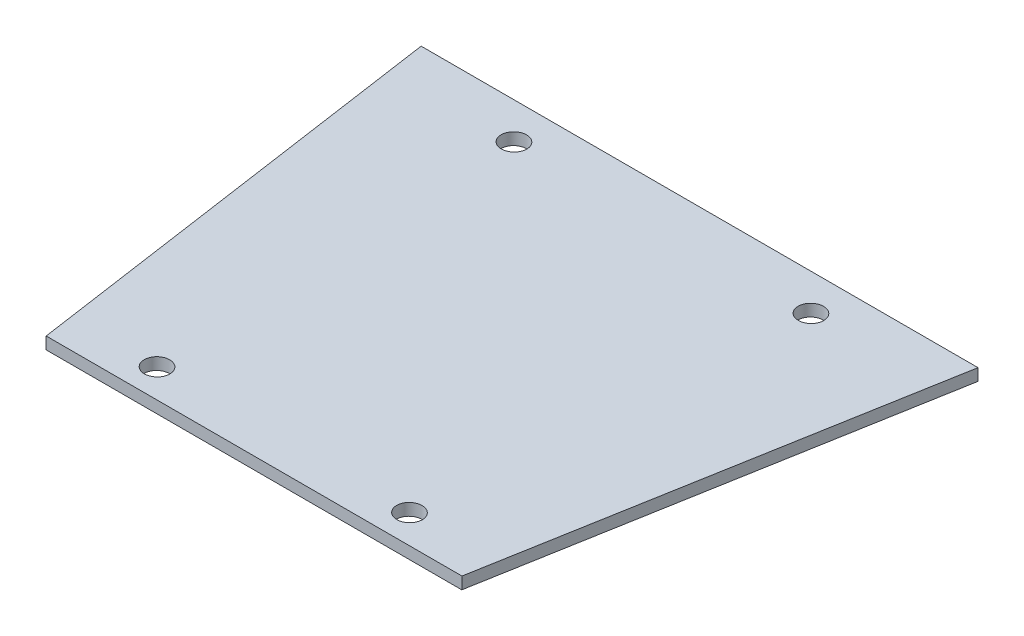
ISO-10303-21;
HEADER;
FILE_DESCRIPTION(('STEP AP214'),'2;1');
FILE_NAME('part.step','',(''),(''),'','','');
FILE_SCHEMA(('AUTOMOTIVE_DESIGN { 1 0 10303 214 1 1 1 1 }'));
ENDSEC;
DATA;
#1=APPLICATION_CONTEXT('core data for automotive mechanical design processes');
#2=APPLICATION_PROTOCOL_DEFINITION('international standard','automotive_design',2000,#1);
#3=PRODUCT_CONTEXT('',#1,'mechanical');
#4=PRODUCT('Part','Part','',(#3));
#5=PRODUCT_RELATED_PRODUCT_CATEGORY('part','',(#4));
#6=PRODUCT_DEFINITION_FORMATION('','',#4);
#7=PRODUCT_DEFINITION_CONTEXT('part definition',#1,'design');
#8=PRODUCT_DEFINITION('design','',#6,#7);
#9=PRODUCT_DEFINITION_SHAPE('','',#8);
#10=(LENGTH_UNIT() NAMED_UNIT(*) SI_UNIT(.MILLI.,.METRE.));
#11=(NAMED_UNIT(*) PLANE_ANGLE_UNIT() SI_UNIT($,.RADIAN.));
#12=(NAMED_UNIT(*) SI_UNIT($,.STERADIAN.) SOLID_ANGLE_UNIT());
#13=UNCERTAINTY_MEASURE_WITH_UNIT(LENGTH_MEASURE(1.E-05),#10,'distance_accuracy_value','');
#14=(GEOMETRIC_REPRESENTATION_CONTEXT(3) GLOBAL_UNCERTAINTY_ASSIGNED_CONTEXT((#13)) GLOBAL_UNIT_ASSIGNED_CONTEXT((#10,
#11,#12)) REPRESENTATION_CONTEXT('',''));
#15=CARTESIAN_POINT('',(0.,0.,0.));
#16=DIRECTION('',(0.,0.,1.));
#17=DIRECTION('',(1.,0.,0.));
#18=AXIS2_PLACEMENT_3D('',#15,#16,#17);
#19=CARTESIAN_POINT('',(-37.5,-26.5998020288418,-48.9398311995993));
#20=DIRECTION('',(0.,0.0157305002504064,0.999876268026135));
#21=DIRECTION('',(0.,-0.999876268026135,0.0157305002504064));
#22=AXIS2_PLACEMENT_3D('',#19,#20,#21);
#23=PLANE('',#22);
#24=DIRECTION('',(1.,0.,0.));
#25=VECTOR('',#24,1.);
#26=CARTESIAN_POINT('',(-37.5,-25.,-48.965));
#27=LINE('',#26,#25);
#28=CARTESIAN_POINT('',(-37.5,-25.,-48.965));
#29=VERTEX_POINT('',#28);
#30=CARTESIAN_POINT('',(37.5,-25.,-48.965));
#31=VERTEX_POINT('',#30);
#32=EDGE_CURVE('E127',#29,#31,#27,.T.);
#33=ORIENTED_EDGE('',*,*,#32,.T.);
#34=DIRECTION('',(0.,0.999876268026135,-0.0157305002504064));
#35=VECTOR('',#34,1.);
#36=CARTESIAN_POINT('',(37.5,-26.5998020288418,-48.9398311995993));
#37=LINE('',#36,#35);
#38=CARTESIAN_POINT('',(37.5,-26.5998020288418,-48.9398311995993));
#39=VERTEX_POINT('',#38);
#40=EDGE_CURVE('E12',#39,#31,#37,.T.);
#41=ORIENTED_EDGE('',*,*,#40,.F.);
#42=DIRECTION('',(1.,0.,0.));
#43=VECTOR('',#42,1.);
#44=CARTESIAN_POINT('',(-37.5,-26.5998020288418,-48.9398311995993));
#45=LINE('',#44,#43);
#46=CARTESIAN_POINT('',(-37.5,-26.5998020288418,-48.9398311995993));
#47=VERTEX_POINT('',#46);
#48=EDGE_CURVE('E109',#47,#39,#45,.T.);
#49=ORIENTED_EDGE('',*,*,#48,.F.);
#50=DIRECTION('',(0.,0.999876268026135,-0.0157305002504064));
#51=VECTOR('',#50,1.);
#52=CARTESIAN_POINT('',(-37.5,-26.5998020288418,-48.9398311995993));
#53=LINE('',#52,#51);
#54=EDGE_CURVE('E123',#47,#29,#53,.T.);
#55=ORIENTED_EDGE('',*,*,#54,.T.);
#56=EDGE_LOOP('',(#33,#41,#49,#55));
#57=FACE_BOUND('',#56,.T.);
#58=ADVANCED_FACE('F44',(#57),#23,.F.);
#59=CARTESIAN_POINT('',(37.5,-26.5998020288418,-48.9398311995993));
#60=DIRECTION('',(-0.987699127302722,-0.00245972083303976,-0.156346997728975));
#61=DIRECTION('',(-0.156347470698502,0.,0.987702115218035));
#62=AXIS2_PLACEMENT_3D('',#59,#60,#61);
#63=PLANE('',#62);
#64=DIRECTION('',(-0.156366345245518,0.0155370013693617,0.987576917340117));
#65=VECTOR('',#64,1.);
#66=CARTESIAN_POINT('',(37.5,-25.,-48.965));
#67=LINE('',#66,#65);
#68=CARTESIAN_POINT('',(28.,-24.0560531885734,11.035));
#69=VERTEX_POINT('',#68);
#70=EDGE_CURVE('E114',#31,#69,#67,.T.);
#71=ORIENTED_EDGE('',*,*,#70,.T.);
#72=DIRECTION('',(0.,0.999876268026135,-0.0157305002504064));
#73=VECTOR('',#72,1.);
#74=CARTESIAN_POINT('',(28.,-25.6558552174152,11.0601688004007));
#75=LINE('',#74,#73);
#76=CARTESIAN_POINT('',(28.,-25.6558552174152,11.0601688004007));
#77=VERTEX_POINT('',#76);
#78=EDGE_CURVE('E61',#77,#69,#75,.T.);
#79=ORIENTED_EDGE('',*,*,#78,.F.);
#80=DIRECTION('',(-0.156366345245518,0.0155370013693617,0.987576917340117));
#81=VECTOR('',#80,1.);
#82=CARTESIAN_POINT('',(37.5,-26.5998020288418,-48.9398311995993));
#83=LINE('',#82,#81);
#84=EDGE_CURVE('E104',#39,#77,#83,.T.);
#85=ORIENTED_EDGE('',*,*,#84,.F.);
#86=ORIENTED_EDGE('',*,*,#40,.T.);
#87=EDGE_LOOP('',(#71,#79,#85,#86));
#88=FACE_BOUND('',#87,.T.);
#89=ADVANCED_FACE('F113',(#88),#63,.F.);
#90=CARTESIAN_POINT('',(28.,-25.6558552174152,11.0601688004007));
#91=DIRECTION('',(0.,-0.0157305002504064,-0.999876268026135));
#92=DIRECTION('',(0.,0.999876268026135,-0.0157305002504064));
#93=AXIS2_PLACEMENT_3D('',#90,#91,#92);
#94=PLANE('',#93);
#95=DIRECTION('',(-1.,0.,0.));
#96=VECTOR('',#95,1.);
#97=CARTESIAN_POINT('',(28.,-24.0560531885734,11.035));
#98=LINE('',#97,#96);
#99=CARTESIAN_POINT('',(-28.,-24.0560531885734,11.035));
#100=VERTEX_POINT('',#99);
#101=EDGE_CURVE('E91',#69,#100,#98,.T.);
#102=ORIENTED_EDGE('',*,*,#101,.T.);
#103=DIRECTION('',(0.,0.999876268026135,-0.0157305002504064));
#104=VECTOR('',#103,1.);
#105=CARTESIAN_POINT('',(-28.,-25.6558552174152,11.0601688004007));
#106=LINE('',#105,#104);
#107=CARTESIAN_POINT('',(-28.,-25.6558552174152,11.0601688004007));
#108=VERTEX_POINT('',#107);
#109=EDGE_CURVE('E115',#108,#100,#106,.T.);
#110=ORIENTED_EDGE('',*,*,#109,.F.);
#111=DIRECTION('',(-1.,0.,0.));
#112=VECTOR('',#111,1.);
#113=CARTESIAN_POINT('',(28.,-25.6558552174152,11.0601688004007));
#114=LINE('',#113,#112);
#115=EDGE_CURVE('E107',#77,#108,#114,.T.);
#116=ORIENTED_EDGE('',*,*,#115,.F.);
#117=ORIENTED_EDGE('',*,*,#78,.T.);
#118=EDGE_LOOP('',(#102,#110,#116,#117));
#119=FACE_BOUND('',#118,.T.);
#120=ADVANCED_FACE('F117',(#119),#94,.F.);
#121=CARTESIAN_POINT('',(-28.,-25.6558552174152,11.0601688004007));
#122=DIRECTION('',(0.987699127302722,-0.00245972083303976,-0.156346997728975));
#123=DIRECTION('',(-0.156347470698502,0.,-0.987702115218035));
#124=AXIS2_PLACEMENT_3D('',#121,#122,#123);
#125=PLANE('',#124);
#126=DIRECTION('',(-0.156366345245518,-0.0155370013693617,-0.987576917340117));
#127=VECTOR('',#126,1.);
#128=CARTESIAN_POINT('',(-28.,-24.0560531885734,11.035));
#129=LINE('',#128,#127);
#130=EDGE_CURVE('E97',#100,#29,#129,.T.);
#131=ORIENTED_EDGE('',*,*,#130,.T.);
#132=ORIENTED_EDGE('',*,*,#54,.F.);
#133=DIRECTION('',(-0.156366345245518,-0.0155370013693617,-0.987576917340117));
#134=VECTOR('',#133,1.);
#135=CARTESIAN_POINT('',(-28.,-25.6558552174152,11.0601688004007));
#136=LINE('',#135,#134);
#137=EDGE_CURVE('E70',#108,#47,#136,.T.);
#138=ORIENTED_EDGE('',*,*,#137,.F.);
#139=ORIENTED_EDGE('',*,*,#109,.T.);
#140=EDGE_LOOP('',(#131,#132,#138,#139));
#141=FACE_BOUND('',#140,.T.);
#142=ADVANCED_FACE('F204',(#141),#125,.F.);
#143=CARTESIAN_POINT('',(0.,-25.8234671719311,0.406266324948725));
#144=DIRECTION('',(0.,-0.999876268026135,0.0157305002504064));
#145=DIRECTION('',(0.,-0.0157305002504064,-0.999876268026135));
#146=AXIS2_PLACEMENT_3D('',#143,#144,#145);
#147=PLANE('',#146);
#148=CARTESIAN_POINT('',(-15.3,-25.7176912052735,7.12969387683311));
#149=CARTESIAN_POINT('',(-15.3000074575271,-25.715945896312,7.24063078177578));
#150=CARTESIAN_POINT('',(-15.3109153937537,-25.7141978684662,7.35174050689907));
#151=CARTESIAN_POINT('',(-15.3542110407633,-25.7107665045529,7.56984795988687));
#152=CARTESIAN_POINT('',(-15.3866406976351,-25.7090833016216,7.67683722523122));
#153=CARTESIAN_POINT('',(-15.4657406471072,-25.7060761577841,7.86798001851794));
#154=CARTESIAN_POINT('',(-15.5097769426127,-25.7047349335491,7.95323212501503));
#155=CARTESIAN_POINT('',(-15.6115030106041,-25.702188875128,8.11506699051708));
#156=CARTESIAN_POINT('',(-15.6691802924556,-25.7009839176498,8.19165758632145));
#157=CARTESIAN_POINT('',(-15.7965939340605,-25.6987429669558,8.33409891882883));
#158=CARTESIAN_POINT('',(-15.8663348125166,-25.6977070373371,8.39994561312714));
#159=CARTESIAN_POINT('',(-16.0158945704555,-25.6958338803725,8.51900890834308));
#160=CARTESIAN_POINT('',(-16.0957150837197,-25.6949966853025,8.5722234577138));
#161=CARTESIAN_POINT('',(-16.2631525622895,-25.6935450531779,8.66449341023633));
#162=CARTESIAN_POINT('',(-16.3507689599073,-25.69293059992,8.7035498433176));
#163=CARTESIAN_POINT('',(-16.5313145609368,-25.6919418123062,8.766400054905));
#164=CARTESIAN_POINT('',(-16.6242436764269,-25.6915674739779,8.79019408591289));
#165=CARTESIAN_POINT('',(-16.8127790158677,-25.6910695250353,8.82184516645357));
#166=CARTESIAN_POINT('',(-16.9083852665919,-25.6909459169295,8.8297020565445));
#167=CARTESIAN_POINT('',(-17.099559683929,-25.6909529444979,8.82925536389327));
#168=CARTESIAN_POINT('',(-17.1951278506659,-25.6910835793371,8.82095183422734));
#169=CARTESIAN_POINT('',(-17.383513548985,-25.6915953829523,8.78842011046653));
#170=CARTESIAN_POINT('',(-17.4763310798676,-25.6919765517921,8.76419191232242));
#171=CARTESIAN_POINT('',(-17.6565809292291,-25.692978604664,8.70049852240995));
#172=CARTESIAN_POINT('',(-17.7440132323654,-25.6935994893791,8.66103328723338));
#173=CARTESIAN_POINT('',(-17.9110103123298,-25.6950633481809,8.56798617161037));
#174=CARTESIAN_POINT('',(-17.9905750958791,-25.6959063220778,8.51440430322373));
#175=CARTESIAN_POINT('',(-18.1395785182171,-25.6977904287752,8.39464501120082));
#176=CARTESIAN_POINT('',(-18.2090171692155,-25.6988315613367,8.32846760275202));
#177=CARTESIAN_POINT('',(-18.3357973030139,-25.7010824317239,8.18539574574242));
#178=CARTESIAN_POINT('',(-18.3931387820436,-25.702292169602,8.10850129384152));
#179=CARTESIAN_POINT('',(-18.4940968087333,-25.704845910012,7.94617813882791));
#180=CARTESIAN_POINT('',(-18.5377133508061,-25.7061899125984,7.86074943224111));
#181=CARTESIAN_POINT('',(-18.6099833161547,-25.7089740293722,7.68378288666455));
#182=CARTESIAN_POINT('',(-18.6386367430484,-25.7104141435363,7.59224504915195));
#183=CARTESIAN_POINT('',(-18.6801671041193,-25.7133496029475,7.40565872612519));
#184=CARTESIAN_POINT('',(-18.693044040377,-25.7148449481875,7.31061024107402));
#185=CARTESIAN_POINT('',(-18.7026558882231,-25.7178484213969,7.11970076356794));
#186=CARTESIAN_POINT('',(-18.6993908006282,-25.7193565493657,7.02383977115413));
#187=CARTESIAN_POINT('',(-18.6768112880253,-25.7223427769155,6.83402647784223));
#188=CARTESIAN_POINT('',(-18.6574968616853,-25.723820876494,6.74007417710255));
#189=CARTESIAN_POINT('',(-18.6033669487931,-25.7267050882885,6.55674530138723));
#190=CARTESIAN_POINT('',(-18.5685514615969,-25.7281112005016,6.46736872660174));
#191=CARTESIAN_POINT('',(-18.4844077453043,-25.7308115218504,6.29572846152964));
#192=CARTESIAN_POINT('',(-18.4350795189959,-25.7321057310076,6.21346476987658));
#193=CARTESIAN_POINT('',(-18.3233106118578,-25.73454550759,6.05838548662219));
#194=CARTESIAN_POINT('',(-18.2608699328263,-25.7356910750357,5.98556989372516));
#195=CARTESIAN_POINT('',(-18.1246485884423,-25.7378010498144,5.85145377066107));
#196=CARTESIAN_POINT('',(-18.0508679165597,-25.7387654570433,5.7901532471251));
#197=CARTESIAN_POINT('',(-17.8940609689405,-25.7404857341267,5.68080744102837));
#198=CARTESIAN_POINT('',(-17.8110346881971,-25.7412416038684,5.63276216564596));
#199=CARTESIAN_POINT('',(-17.6380936271831,-25.7425233482509,5.5512907712652));
#200=CARTESIAN_POINT('',(-17.5481788569836,-25.7430492232279,5.51786463089404));
#201=CARTESIAN_POINT('',(-17.3640128935392,-25.7438560484084,5.46658047988007));
#202=CARTESIAN_POINT('',(-17.2697617016936,-25.7441369986908,5.44872246421387));
#203=CARTESIAN_POINT('',(-17.0795991206199,-25.7444460115489,5.4290807097655));
#204=CARTESIAN_POINT('',(-16.9836877275647,-25.7444740735414,5.42729700804229));
#205=CARTESIAN_POINT('',(-16.7929243050332,-25.744276468143,5.43985738089908));
#206=CARTESIAN_POINT('',(-16.698072272207,-25.7440508015544,5.45420140446876));
#207=CARTESIAN_POINT('',(-16.5121328824923,-25.7433523085507,5.49859964779604));
#208=CARTESIAN_POINT('',(-16.421045541164,-25.7428794811141,5.52865393248048));
#209=CARTESIAN_POINT('',(-16.2451689618318,-25.7416994601344,5.60365949203851));
#210=CARTESIAN_POINT('',(-16.1603799035833,-25.7409922599053,5.64861119189014));
#211=CARTESIAN_POINT('',(-16.0398538950777,-25.7397723142387,5.72615448046165));
#212=CARTESIAN_POINT('',(-16.0007819641238,-25.7393390526166,5.75369384710073));
#213=CARTESIAN_POINT('',(-15.9250548331084,-25.7384219371265,5.81198837041566));
#214=CARTESIAN_POINT('',(-15.8884019977871,-25.7379380349161,5.84274659987375));
#215=CARTESIAN_POINT('',(-15.782583910405,-25.7364165293497,5.93945791122831));
#216=CARTESIAN_POINT('',(-15.7174512204564,-25.735308032964,6.00991715992789));
#217=CARTESIAN_POINT('',(-15.5999604318101,-25.7329346313914,6.16077745484117));
#218=CARTESIAN_POINT('',(-15.5476019692009,-25.7316697306618,6.2411782177431));
#219=CARTESIAN_POINT('',(-15.4797371971144,-25.7296825301218,6.36749045372494));
#220=CARTESIAN_POINT('',(-15.4588772754744,-25.7290043546643,6.41059725482617));
#221=CARTESIAN_POINT('',(-15.4208797937376,-25.7276234558045,6.49837119567405));
#222=CARTESIAN_POINT('',(-15.4037390936828,-25.7269207536953,6.54303698196598));
#223=CARTESIAN_POINT('',(-15.3581149310422,-25.7247839311414,6.6788596275671));
#224=CARTESIAN_POINT('',(-15.3353268392319,-25.7233180848483,6.77203307391357));
#225=CARTESIAN_POINT('',(-15.3136958040561,-25.7211494939524,6.90987500756469));
#226=CARTESIAN_POINT('',(-15.3085663040028,-25.7204605611036,6.9536655796893));
#227=CARTESIAN_POINT('',(-15.3017164191259,-25.7190782979494,7.04152623905005));
#228=CARTESIAN_POINT('',(-15.2999970356295,-25.7183849664123,7.08559640457471));
#229=CARTESIAN_POINT('',(-15.3,-25.7176912052735,7.12969387683311));
#230=B_SPLINE_CURVE_WITH_KNOTS('',3,(#148,#149,#150,#151,#152,#153,#154,#155,#156,#157,#158,
#159,#160,#161,#162,#163,#164,#165,#166,#167,#168,#169,#170,#171,#172,#173,#174,#175,#176,#177,
#178,#179,#180,#181,#182,#183,#184,#185,#186,#187,#188,#189,#190,#191,#192,#193,#194,#195,#196,
#197,#198,#199,#200,#201,#202,#203,#204,#205,#206,#207,#208,#209,#210,#211,#212,#213,#214,#215,
#216,#217,#218,#219,#220,#221,#222,#223,#224,#225,#226,#227,#228,#229),.UNSPECIFIED.,.T.,.F.,(4,
2,2,2,2,2,2,2,2,2,2,2,2,2,2,2,2,2,2,2,2,2,2,2,2,2,2,2,2,2,2,2,2,2,2,2,2,2,2,2,4),(0.,
0.332630497506824,0.665911207256757,0.952465656796069,1.23875872618724,1.5251592664983,
1.81160628844606,2.09803246867666,2.38445391013945,2.6708782170688,2.95730158328657,
3.24372502233473,3.53014927736965,3.81657328771387,4.10299695269568,4.3894207069455,
4.67584457779209,4.96226837938307,5.2486921431999,5.53511589252322,5.82153966561916,
6.10796345061715,6.39438718059008,6.68081087128345,6.9672347269171,7.25365873766293,
7.54008232966262,7.82650582924143,8.11292998916312,8.39935324315752,8.68577768088173,
8.97221029012922,9.11547623830682,9.25888022024597,9.54530812209807,9.83172786325189,
9.9752557296505,10.1186619468678,10.4048310046024,10.5370129774897,10.6692337577943),.UNSPECIFIED.);
#231=CARTESIAN_POINT('',(-15.3,-25.7176912052735,7.12969387683311));
#232=VERTEX_POINT('',#231);
#233=EDGE_CURVE('E154',#232,#232,#230,.T.);
#234=ORIENTED_EDGE('',*,*,#233,.F.);
#235=EDGE_LOOP('',(#234));
#236=FACE_BOUND('',#235,.T.);
#237=CARTESIAN_POINT('',(18.7,-25.7176912052735,7.12969387683311));
#238=CARTESIAN_POINT('',(18.6999925424729,-25.715945896312,7.24063078177578));
#239=CARTESIAN_POINT('',(18.6890846062463,-25.7141978684662,7.35174050689907));
#240=CARTESIAN_POINT('',(18.6457889592367,-25.7107665045529,7.56984795988687));
#241=CARTESIAN_POINT('',(18.6133593023649,-25.7090833016216,7.67683722523122));
#242=CARTESIAN_POINT('',(18.5342593528928,-25.7060761577841,7.86798001851794));
#243=CARTESIAN_POINT('',(18.4902230573873,-25.7047349335491,7.95323212501503));
#244=CARTESIAN_POINT('',(18.3884969893959,-25.702188875128,8.11506699051708));
#245=CARTESIAN_POINT('',(18.3308197075444,-25.7009839176498,8.19165758632145));
#246=CARTESIAN_POINT('',(18.2034060659395,-25.6987429669558,8.33409891882883));
#247=CARTESIAN_POINT('',(18.1336651874834,-25.6977070373371,8.39994561312714));
#248=CARTESIAN_POINT('',(17.9841054295445,-25.6958338803725,8.51900890834308));
#249=CARTESIAN_POINT('',(17.9042849162803,-25.6949966853025,8.5722234577138));
#250=CARTESIAN_POINT('',(17.7368474377105,-25.6935450531779,8.66449341023633));
#251=CARTESIAN_POINT('',(17.6492310400927,-25.69293059992,8.7035498433176));
#252=CARTESIAN_POINT('',(17.4686854390632,-25.6919418123062,8.766400054905));
#253=CARTESIAN_POINT('',(17.3757563235731,-25.6915674739779,8.79019408591289));
#254=CARTESIAN_POINT('',(17.1872209841323,-25.6910695250353,8.82184516645357));
#255=CARTESIAN_POINT('',(17.0916147334081,-25.6909459169295,8.8297020565445));
#256=CARTESIAN_POINT('',(16.900440316071,-25.6909529444979,8.82925536389327));
#257=CARTESIAN_POINT('',(16.8048721493341,-25.6910835793371,8.82095183422734));
#258=CARTESIAN_POINT('',(16.6164864510151,-25.6915953829523,8.78842011046653));
#259=CARTESIAN_POINT('',(16.5236689201324,-25.6919765517921,8.76419191232242));
#260=CARTESIAN_POINT('',(16.3434190707709,-25.692978604664,8.70049852240995));
#261=CARTESIAN_POINT('',(16.2559867676346,-25.6935994893791,8.66103328723338));
#262=CARTESIAN_POINT('',(16.0889896876702,-25.6950633481809,8.56798617161037));
#263=CARTESIAN_POINT('',(16.0094249041209,-25.6959063220778,8.51440430322373));
#264=CARTESIAN_POINT('',(15.8604214817829,-25.6977904287752,8.39464501120082));
#265=CARTESIAN_POINT('',(15.7909828307845,-25.6988315613367,8.32846760275202));
#266=CARTESIAN_POINT('',(15.6642026969861,-25.7010824317239,8.18539574574242));
#267=CARTESIAN_POINT('',(15.6068612179564,-25.702292169602,8.10850129384152));
#268=CARTESIAN_POINT('',(15.5059031912667,-25.704845910012,7.94617813882791));
#269=CARTESIAN_POINT('',(15.4622866491939,-25.7061899125984,7.8607494322411));
#270=CARTESIAN_POINT('',(15.3900166838453,-25.7089740293722,7.68378288666455));
#271=CARTESIAN_POINT('',(15.3613632569516,-25.7104141435363,7.59224504915195));
#272=CARTESIAN_POINT('',(15.3198328958807,-25.7133496029475,7.40565872612519));
#273=CARTESIAN_POINT('',(15.306955959623,-25.7148449481875,7.31061024107402));
#274=CARTESIAN_POINT('',(15.2973441117769,-25.7178484213969,7.11970076356794));
#275=CARTESIAN_POINT('',(15.3006091993718,-25.7193565493657,7.02383977115414));
#276=CARTESIAN_POINT('',(15.3231887119747,-25.7223427769155,6.83402647784223));
#277=CARTESIAN_POINT('',(15.3425031383147,-25.723820876494,6.74007417710255));
#278=CARTESIAN_POINT('',(15.3966330512069,-25.7267050882885,6.55674530138723));
#279=CARTESIAN_POINT('',(15.4314485384031,-25.7281112005016,6.46736872660174));
#280=CARTESIAN_POINT('',(15.5155922546957,-25.7308115218504,6.29572846152964));
#281=CARTESIAN_POINT('',(15.5649204810041,-25.7321057310076,6.21346476987658));
#282=CARTESIAN_POINT('',(15.6766893881422,-25.73454550759,6.05838548662219));
#283=CARTESIAN_POINT('',(15.7391300671737,-25.7356910750357,5.98556989372517));
#284=CARTESIAN_POINT('',(15.8753514115577,-25.7378010498144,5.85145377066107));
#285=CARTESIAN_POINT('',(15.9491320834403,-25.7387654570433,5.79015324712511));
#286=CARTESIAN_POINT('',(16.1059390310595,-25.7404857341267,5.68080744102837));
#287=CARTESIAN_POINT('',(16.1889653118029,-25.7412416038684,5.63276216564597));
#288=CARTESIAN_POINT('',(16.3619063728169,-25.7425233482509,5.55129077126521));
#289=CARTESIAN_POINT('',(16.4518211430164,-25.7430492232279,5.51786463089404));
#290=CARTESIAN_POINT('',(16.6359871064608,-25.7438560484084,5.46658047988007));
#291=CARTESIAN_POINT('',(16.7302382983064,-25.7441369986908,5.44872246421387));
#292=CARTESIAN_POINT('',(16.9204008793802,-25.7444460115489,5.4290807097655));
#293=CARTESIAN_POINT('',(17.0163122724353,-25.7444740735414,5.42729700804229));
#294=CARTESIAN_POINT('',(17.2070756949669,-25.744276468143,5.43985738089908));
#295=CARTESIAN_POINT('',(17.301927727793,-25.7440508015544,5.45420140446876));
#296=CARTESIAN_POINT('',(17.4878671175077,-25.7433523085507,5.49859964779604));
#297=CARTESIAN_POINT('',(17.578954458836,-25.7428794811141,5.52865393248048));
#298=CARTESIAN_POINT('',(17.7548310381682,-25.7416994601344,5.60365949203851));
#299=CARTESIAN_POINT('',(17.8396200964167,-25.7409922599053,5.64861119189014));
#300=CARTESIAN_POINT('',(17.9601461049223,-25.7397723142387,5.72615448046165));
#301=CARTESIAN_POINT('',(17.9992180358762,-25.7393390526166,5.75369384710073));
#302=CARTESIAN_POINT('',(18.0749451668916,-25.7384219371265,5.81198837041566));
#303=CARTESIAN_POINT('',(18.1115980022129,-25.7379380349161,5.84274659987375));
#304=CARTESIAN_POINT('',(18.217416089595,-25.7364165293497,5.93945791122831));
#305=CARTESIAN_POINT('',(18.2825487795436,-25.735308032964,6.00991715992789));
#306=CARTESIAN_POINT('',(18.4000395681899,-25.7329346313914,6.16077745484116));
#307=CARTESIAN_POINT('',(18.4523980307991,-25.7316697306618,6.2411782177431));
#308=CARTESIAN_POINT('',(18.5202628028856,-25.7296825301218,6.36749045372494));
#309=CARTESIAN_POINT('',(18.5411227245256,-25.7290043546643,6.41059725482616));
#310=CARTESIAN_POINT('',(18.5791202062624,-25.7276234558045,6.49837119567405));
#311=CARTESIAN_POINT('',(18.5962609063172,-25.7269207536953,6.54303698196598));
#312=CARTESIAN_POINT('',(18.6418850689578,-25.7247839311414,6.6788596275671));
#313=CARTESIAN_POINT('',(18.6646731607681,-25.7233180848483,6.77203307391357));
#314=CARTESIAN_POINT('',(18.6863041959439,-25.7211494939524,6.90987500756469));
#315=CARTESIAN_POINT('',(18.6914336959972,-25.7204605611036,6.9536655796893));
#316=CARTESIAN_POINT('',(18.6982835808741,-25.7190782979494,7.04152623905005));
#317=CARTESIAN_POINT('',(18.7000029643705,-25.7183849664123,7.08559640457471));
#318=CARTESIAN_POINT('',(18.7,-25.7176912052735,7.12969387683311));
#319=B_SPLINE_CURVE_WITH_KNOTS('',3,(#237,#238,#239,#240,#241,#242,#243,#244,#245,#246,#247,
#248,#249,#250,#251,#252,#253,#254,#255,#256,#257,#258,#259,#260,#261,#262,#263,#264,#265,#266,
#267,#268,#269,#270,#271,#272,#273,#274,#275,#276,#277,#278,#279,#280,#281,#282,#283,#284,#285,
#286,#287,#288,#289,#290,#291,#292,#293,#294,#295,#296,#297,#298,#299,#300,#301,#302,#303,#304,
#305,#306,#307,#308,#309,#310,#311,#312,#313,#314,#315,#316,#317,#318),.UNSPECIFIED.,.T.,.F.,(4,
2,2,2,2,2,2,2,2,2,2,2,2,2,2,2,2,2,2,2,2,2,2,2,2,2,2,2,2,2,2,2,2,2,2,2,2,2,2,2,4),(0.,
0.332630497506824,0.665911207256758,0.952465656796071,1.23875872618724,1.5251592664983,
1.81160628844606,2.09803246867666,2.38445391013945,2.6708782170688,2.95730158328657,
3.24372502233473,3.53014927736965,3.81657328771387,4.10299695269568,4.3894207069455,
4.67584457779209,4.96226837938307,5.24869214319989,5.53511589252322,5.82153966561916,
6.10796345061714,6.39438718059007,6.68081087128345,6.9672347269171,7.25365873766293,
7.54008232966262,7.82650582924143,8.11292998916313,8.39935324315752,8.68577768088173,
8.97221029012922,9.11547623830682,9.25888022024597,9.54530812209807,9.8317278632519,
9.9752557296505,10.1186619468678,10.4048310046024,10.5370129774897,10.6692337577943),.UNSPECIFIED.);
#320=CARTESIAN_POINT('',(18.7,-25.7176912052735,7.12969387683311));
#321=VERTEX_POINT('',#320);
#322=EDGE_CURVE('E147',#321,#321,#319,.T.);
#323=ORIENTED_EDGE('',*,*,#322,.F.);
#324=EDGE_LOOP('',(#323));
#325=FACE_BOUND('',#324,.T.);
#326=CARTESIAN_POINT('',(20.,-26.5211495275898,-43.9404498594687));
#327=DIRECTION('',(0.,-0.999876268026135,0.0157305002504064));
#328=DIRECTION('',(0.,-0.0157305002504064,-0.999876268026135));
#329=AXIS2_PLACEMENT_3D('',#326,#327,#328);
#330=CIRCLE('',#329,1.7);
#331=CARTESIAN_POINT('',(20.,-26.5478913780155,-45.6402395151131));
#332=VERTEX_POINT('',#331);
#333=EDGE_CURVE('E143',#332,#332,#330,.T.);
#334=ORIENTED_EDGE('',*,*,#333,.F.);
#335=EDGE_LOOP('',(#334));
#336=FACE_BOUND('',#335,.T.);
#337=CARTESIAN_POINT('',(-20.,-26.5211495275898,-43.9404498594687));
#338=DIRECTION('',(0.,-0.999876268026135,0.0157305002504064));
#339=DIRECTION('',(0.,-0.0157305002504064,-0.999876268026135));
#340=AXIS2_PLACEMENT_3D('',#337,#338,#339);
#341=CIRCLE('',#340,1.7);
#342=CARTESIAN_POINT('',(-20.,-26.5478913780155,-45.6402395151131));
#343=VERTEX_POINT('',#342);
#344=EDGE_CURVE('E181',#343,#343,#341,.T.);
#345=ORIENTED_EDGE('',*,*,#344,.F.);
#346=EDGE_LOOP('',(#345));
#347=FACE_BOUND('',#346,.T.);
#348=ORIENTED_EDGE('',*,*,#48,.T.);
#349=ORIENTED_EDGE('',*,*,#84,.T.);
#350=ORIENTED_EDGE('',*,*,#115,.T.);
#351=ORIENTED_EDGE('',*,*,#137,.T.);
#352=EDGE_LOOP('',(#348,#349,#350,#351));
#353=FACE_BOUND('',#352,.T.);
#354=ADVANCED_FACE('F105',(#236,#325,#336,#347,#353),#147,.T.);
#355=CARTESIAN_POINT('',(0.,-24.2236651430893,0.381097524548075));
#356=DIRECTION('',(0.,-0.999876268026135,0.0157305002504064));
#357=DIRECTION('',(0.,-0.0157305002504064,-0.999876268026135));
#358=AXIS2_PLACEMENT_3D('',#355,#356,#357);
#359=PLANE('',#358);
#360=CARTESIAN_POINT('',(-15.3,-24.1178891764316,7.10452507643246));
#361=CARTESIAN_POINT('',(-15.3000074575271,-24.1161438674702,7.21546198137513));
#362=CARTESIAN_POINT('',(-15.3109153937537,-24.1143958396243,7.32657170649842));
#363=CARTESIAN_POINT('',(-15.3542110407633,-24.1109644757111,7.54467915948622));
#364=CARTESIAN_POINT('',(-15.3866406976351,-24.1092812727798,7.65166842483057));
#365=CARTESIAN_POINT('',(-15.4657406471072,-24.1062741289423,7.84281121811729));
#366=CARTESIAN_POINT('',(-15.5097769426127,-24.1049329047073,7.92806332461438));
#367=CARTESIAN_POINT('',(-15.6115030106041,-24.1023868462862,8.08989819011643));
#368=CARTESIAN_POINT('',(-15.6691802924556,-24.1011818888079,8.16648878592079));
#369=CARTESIAN_POINT('',(-15.7965939340605,-24.098940938114,8.30893011842818));
#370=CARTESIAN_POINT('',(-15.8663348125166,-24.0979050084953,8.37477681272649));
#371=CARTESIAN_POINT('',(-16.0158945704555,-24.0960318515306,8.49384010794243));
#372=CARTESIAN_POINT('',(-16.0957150837197,-24.0951946564606,8.54705465731315));
#373=CARTESIAN_POINT('',(-16.2631525622895,-24.0937430243361,8.63932460983568));
#374=CARTESIAN_POINT('',(-16.3507689599073,-24.0931285710782,8.67838104291695));
#375=CARTESIAN_POINT('',(-16.5313145609368,-24.0921397834644,8.74123125450435));
#376=CARTESIAN_POINT('',(-16.6242436764269,-24.0917654451361,8.76502528551224));
#377=CARTESIAN_POINT('',(-16.8127790158677,-24.0912674961935,8.79667636605292));
#378=CARTESIAN_POINT('',(-16.9083852665919,-24.0911438880877,8.80453325614385));
#379=CARTESIAN_POINT('',(-17.099559683929,-24.0911509156561,8.80408656349262));
#380=CARTESIAN_POINT('',(-17.1951278506659,-24.0912815504953,8.79578303382669));
#381=CARTESIAN_POINT('',(-17.383513548985,-24.0917933541105,8.76325131006588));
#382=CARTESIAN_POINT('',(-17.4763310798676,-24.0921745229503,8.73902311192177));
#383=CARTESIAN_POINT('',(-17.6565809292291,-24.0931765758222,8.6753297220093));
#384=CARTESIAN_POINT('',(-17.7440132323654,-24.0937974605373,8.63586448683273));
#385=CARTESIAN_POINT('',(-17.9110103123298,-24.0952613193391,8.54281737120972));
#386=CARTESIAN_POINT('',(-17.9905750958791,-24.096104293236,8.48923550282308));
#387=CARTESIAN_POINT('',(-18.1395785182171,-24.0979883999334,8.36947621080017));
#388=CARTESIAN_POINT('',(-18.2090171692155,-24.0990295324949,8.30329880235137));
#389=CARTESIAN_POINT('',(-18.3357973030139,-24.1012804028821,8.16022694534177));
#390=CARTESIAN_POINT('',(-18.3931387820436,-24.1024901407602,8.08333249344087));
#391=CARTESIAN_POINT('',(-18.4940968087333,-24.1050438811702,7.92100933842726));
#392=CARTESIAN_POINT('',(-18.5377133508061,-24.1063878837566,7.83558063184046));
#393=CARTESIAN_POINT('',(-18.6099833161547,-24.1091720005304,7.6586140862639));
#394=CARTESIAN_POINT('',(-18.6386367430484,-24.1106121146944,7.5670762487513));
#395=CARTESIAN_POINT('',(-18.6801671041193,-24.1135475741057,7.38048992572454));
#396=CARTESIAN_POINT('',(-18.693044040377,-24.1150429193457,7.28544144067337));
#397=CARTESIAN_POINT('',(-18.7026558882231,-24.118046392555,7.09453196316729));
#398=CARTESIAN_POINT('',(-18.6993908006282,-24.1195545205239,6.99867097075349));
#399=CARTESIAN_POINT('',(-18.6768112880253,-24.1225407480737,6.80885767744158));
#400=CARTESIAN_POINT('',(-18.6574968616853,-24.1240188476521,6.7149053767019));
#401=CARTESIAN_POINT('',(-18.6033669487931,-24.1269030594467,6.53157650098658));
#402=CARTESIAN_POINT('',(-18.5685514615969,-24.1283091716598,6.44219992620108));
#403=CARTESIAN_POINT('',(-18.4844077453043,-24.1310094930086,6.27055966112899));
#404=CARTESIAN_POINT('',(-18.4350795189959,-24.1323037021658,6.18829596947593));
#405=CARTESIAN_POINT('',(-18.3233106118578,-24.1347434787482,6.03321668622154));
#406=CARTESIAN_POINT('',(-18.2608699328263,-24.1358890461938,5.96040109332451));
#407=CARTESIAN_POINT('',(-18.1246485884423,-24.1379990209726,5.82628497026042));
#408=CARTESIAN_POINT('',(-18.0508679165597,-24.1389634282015,5.76498444672445));
#409=CARTESIAN_POINT('',(-17.8940609689405,-24.1406837052849,5.65563864062772));
#410=CARTESIAN_POINT('',(-17.8110346881971,-24.1414395750266,5.60759336524532));
#411=CARTESIAN_POINT('',(-17.6380936271831,-24.1427213194091,5.52612197086455));
#412=CARTESIAN_POINT('',(-17.5481788569836,-24.1432471943861,5.49269583049339));
#413=CARTESIAN_POINT('',(-17.3640128935392,-24.1440540195666,5.44141167947942));
#414=CARTESIAN_POINT('',(-17.2697617016936,-24.144334969849,5.42355366381322));
#415=CARTESIAN_POINT('',(-17.0795991206199,-24.144643982707,5.40391190936485));
#416=CARTESIAN_POINT('',(-16.9836877275647,-24.1446720446996,5.40212820764164));
#417=CARTESIAN_POINT('',(-16.7929243050332,-24.1444744393011,5.41468858049843));
#418=CARTESIAN_POINT('',(-16.698072272207,-24.1442487727126,5.42903260406811));
#419=CARTESIAN_POINT('',(-16.5121328824923,-24.1435502797089,5.47343084739539));
#420=CARTESIAN_POINT('',(-16.421045541164,-24.1430774522723,5.50348513207983));
#421=CARTESIAN_POINT('',(-16.2451689618318,-24.1418974312926,5.57849069163786));
#422=CARTESIAN_POINT('',(-16.1603799035833,-24.1411902310635,5.62344239148949));
#423=CARTESIAN_POINT('',(-16.0398538950777,-24.1399702853969,5.700985680061));
#424=CARTESIAN_POINT('',(-16.0007819641238,-24.1395370237748,5.72852504670007));
#425=CARTESIAN_POINT('',(-15.9250548331084,-24.1386199082847,5.78681957001501));
#426=CARTESIAN_POINT('',(-15.8884019977871,-24.1381360060743,5.8175777994731));
#427=CARTESIAN_POINT('',(-15.782583910405,-24.1366145005079,5.91428911082766));
#428=CARTESIAN_POINT('',(-15.7174512204563,-24.1355060041222,5.98474835952724));
#429=CARTESIAN_POINT('',(-15.5999604318101,-24.1331326025496,6.13560865444051));
#430=CARTESIAN_POINT('',(-15.5476019692009,-24.13186770182,6.21600941734244));
#431=CARTESIAN_POINT('',(-15.4797371971144,-24.12988050128,6.34232165332429));
#432=CARTESIAN_POINT('',(-15.4588772754744,-24.1292023258225,6.38542845442552));
#433=CARTESIAN_POINT('',(-15.4208797937376,-24.1278214269627,6.4732023952734));
#434=CARTESIAN_POINT('',(-15.4037390936828,-24.1271187248535,6.51786818156533));
#435=CARTESIAN_POINT('',(-15.3581149310422,-24.1249819022996,6.65369082716645));
#436=CARTESIAN_POINT('',(-15.3353268392319,-24.1235160560065,6.74686427351292));
#437=CARTESIAN_POINT('',(-15.3136958040561,-24.1213474651106,6.88470620716404));
#438=CARTESIAN_POINT('',(-15.3085663040028,-24.1206585322618,6.92849677928865));
#439=CARTESIAN_POINT('',(-15.3017164191259,-24.1192762691076,7.0163574386494));
#440=CARTESIAN_POINT('',(-15.2999970356295,-24.1185829375705,7.06042760417406));
#441=CARTESIAN_POINT('',(-15.3,-24.1178891764316,7.10452507643246));
#442=B_SPLINE_CURVE_WITH_KNOTS('',3,(#360,#361,#362,#363,#364,#365,#366,#367,#368,#369,#370,
#371,#372,#373,#374,#375,#376,#377,#378,#379,#380,#381,#382,#383,#384,#385,#386,#387,#388,#389,
#390,#391,#392,#393,#394,#395,#396,#397,#398,#399,#400,#401,#402,#403,#404,#405,#406,#407,#408,
#409,#410,#411,#412,#413,#414,#415,#416,#417,#418,#419,#420,#421,#422,#423,#424,#425,#426,#427,
#428,#429,#430,#431,#432,#433,#434,#435,#436,#437,#438,#439,#440,#441),.UNSPECIFIED.,.T.,.F.,(4,
2,2,2,2,2,2,2,2,2,2,2,2,2,2,2,2,2,2,2,2,2,2,2,2,2,2,2,2,2,2,2,2,2,2,2,2,2,2,2,4),(0.,
0.332630497506825,0.665911207256758,0.95246565679607,1.23875872618724,1.52515926649831,
1.81160628844606,2.09803246867666,2.38445391013945,2.6708782170688,2.95730158328657,
3.24372502233473,3.53014927736965,3.81657328771387,4.10299695269568,4.38942070694549,
4.67584457779209,4.96226837938307,5.24869214319989,5.53511589252322,5.82153966561917,
6.10796345061715,6.39438718059008,6.68081087128345,6.9672347269171,7.25365873766293,
7.54008232966262,7.82650582924143,8.11292998916312,8.39935324315752,8.68577768088173,
8.97221029012922,9.11547623830681,9.25888022024597,9.54530812209807,9.83172786325189,
9.9752557296505,10.1186619468678,10.4048310046024,10.5370129774897,10.6692337577943),.UNSPECIFIED.);
#443=CARTESIAN_POINT('',(-15.3,-24.1178891764316,7.10452507643246));
#444=VERTEX_POINT('',#443);
#445=EDGE_CURVE('E50',#444,#444,#442,.T.);
#446=ORIENTED_EDGE('',*,*,#445,.T.);
#447=EDGE_LOOP('',(#446));
#448=FACE_BOUND('',#447,.T.);
#449=CARTESIAN_POINT('',(18.7,-24.1178891764316,7.10452507643246));
#450=CARTESIAN_POINT('',(18.6999925424729,-24.1161438674702,7.21546198137513));
#451=CARTESIAN_POINT('',(18.6890846062463,-24.1143958396243,7.32657170649842));
#452=CARTESIAN_POINT('',(18.6457889592367,-24.1109644757111,7.54467915948622));
#453=CARTESIAN_POINT('',(18.6133593023649,-24.1092812727798,7.65166842483057));
#454=CARTESIAN_POINT('',(18.5342593528928,-24.1062741289423,7.84281121811729));
#455=CARTESIAN_POINT('',(18.4902230573873,-24.1049329047073,7.92806332461439));
#456=CARTESIAN_POINT('',(18.3884969893959,-24.1023868462862,8.08989819011643));
#457=CARTESIAN_POINT('',(18.3308197075444,-24.1011818888079,8.1664887859208));
#458=CARTESIAN_POINT('',(18.2034060659395,-24.098940938114,8.30893011842818));
#459=CARTESIAN_POINT('',(18.1336651874834,-24.0979050084953,8.37477681272649));
#460=CARTESIAN_POINT('',(17.9841054295445,-24.0960318515306,8.49384010794243));
#461=CARTESIAN_POINT('',(17.9042849162803,-24.0951946564606,8.54705465731315));
#462=CARTESIAN_POINT('',(17.7368474377105,-24.0937430243361,8.63932460983568));
#463=CARTESIAN_POINT('',(17.6492310400927,-24.0931285710782,8.67838104291695));
#464=CARTESIAN_POINT('',(17.4686854390632,-24.0921397834644,8.74123125450435));
#465=CARTESIAN_POINT('',(17.3757563235731,-24.0917654451361,8.76502528551224));
#466=CARTESIAN_POINT('',(17.1872209841323,-24.0912674961935,8.79667636605292));
#467=CARTESIAN_POINT('',(17.0916147334081,-24.0911438880877,8.80453325614385));
#468=CARTESIAN_POINT('',(16.900440316071,-24.0911509156561,8.80408656349262));
#469=CARTESIAN_POINT('',(16.8048721493341,-24.0912815504953,8.79578303382669));
#470=CARTESIAN_POINT('',(16.6164864510151,-24.0917933541105,8.76325131006588));
#471=CARTESIAN_POINT('',(16.5236689201324,-24.0921745229503,8.73902311192177));
#472=CARTESIAN_POINT('',(16.3434190707709,-24.0931765758222,8.6753297220093));
#473=CARTESIAN_POINT('',(16.2559867676346,-24.0937974605373,8.63586448683273));
#474=CARTESIAN_POINT('',(16.0889896876702,-24.0952613193391,8.54281737120972));
#475=CARTESIAN_POINT('',(16.0094249041209,-24.096104293236,8.48923550282308));
#476=CARTESIAN_POINT('',(15.8604214817829,-24.0979883999334,8.36947621080017));
#477=CARTESIAN_POINT('',(15.7909828307845,-24.0990295324949,8.30329880235137));
#478=CARTESIAN_POINT('',(15.6642026969861,-24.1012804028821,8.16022694534177));
#479=CARTESIAN_POINT('',(15.6068612179564,-24.1024901407602,8.08333249344087));
#480=CARTESIAN_POINT('',(15.5059031912667,-24.1050438811702,7.92100933842726));
#481=CARTESIAN_POINT('',(15.4622866491939,-24.1063878837566,7.83558063184045));
#482=CARTESIAN_POINT('',(15.3900166838453,-24.1091720005304,7.65861408626389));
#483=CARTESIAN_POINT('',(15.3613632569516,-24.1106121146945,7.5670762487513));
#484=CARTESIAN_POINT('',(15.3198328958807,-24.1135475741057,7.38048992572454));
#485=CARTESIAN_POINT('',(15.306955959623,-24.1150429193457,7.28544144067337));
#486=CARTESIAN_POINT('',(15.2973441117769,-24.118046392555,7.09453196316729));
#487=CARTESIAN_POINT('',(15.3006091993718,-24.1195545205239,6.99867097075349));
#488=CARTESIAN_POINT('',(15.3231887119747,-24.1225407480737,6.80885767744158));
#489=CARTESIAN_POINT('',(15.3425031383147,-24.1240188476521,6.7149053767019));
#490=CARTESIAN_POINT('',(15.3966330512069,-24.1269030594467,6.53157650098658));
#491=CARTESIAN_POINT('',(15.4314485384031,-24.1283091716598,6.44219992620109));
#492=CARTESIAN_POINT('',(15.5155922546957,-24.1310094930086,6.27055966112899));
#493=CARTESIAN_POINT('',(15.5649204810041,-24.1323037021658,6.18829596947593));
#494=CARTESIAN_POINT('',(15.6766893881422,-24.1347434787482,6.03321668622154));
#495=CARTESIAN_POINT('',(15.7391300671737,-24.1358890461938,5.96040109332452));
#496=CARTESIAN_POINT('',(15.8753514115577,-24.1379990209726,5.82628497026042));
#497=CARTESIAN_POINT('',(15.9491320834403,-24.1389634282015,5.76498444672445));
#498=CARTESIAN_POINT('',(16.1059390310595,-24.1406837052849,5.65563864062772));
#499=CARTESIAN_POINT('',(16.1889653118029,-24.1414395750266,5.60759336524532));
#500=CARTESIAN_POINT('',(16.3619063728169,-24.1427213194091,5.52612197086456));
#501=CARTESIAN_POINT('',(16.4518211430164,-24.1432471943861,5.49269583049339));
#502=CARTESIAN_POINT('',(16.6359871064608,-24.1440540195666,5.44141167947942));
#503=CARTESIAN_POINT('',(16.7302382983064,-24.144334969849,5.42355366381322));
#504=CARTESIAN_POINT('',(16.9204008793801,-24.144643982707,5.40391190936485));
#505=CARTESIAN_POINT('',(17.0163122724353,-24.1446720446996,5.40212820764164));
#506=CARTESIAN_POINT('',(17.2070756949669,-24.1444744393011,5.41468858049843));
#507=CARTESIAN_POINT('',(17.301927727793,-24.1442487727126,5.42903260406811));
#508=CARTESIAN_POINT('',(17.4878671175077,-24.1435502797089,5.47343084739539));
#509=CARTESIAN_POINT('',(17.578954458836,-24.1430774522723,5.50348513207983));
#510=CARTESIAN_POINT('',(17.7548310381682,-24.1418974312926,5.57849069163786));
#511=CARTESIAN_POINT('',(17.8396200964167,-24.1411902310635,5.62344239148949));
#512=CARTESIAN_POINT('',(17.9601461049223,-24.1399702853969,5.700985680061));
#513=CARTESIAN_POINT('',(17.9992180358762,-24.1395370237748,5.72852504670007));
#514=CARTESIAN_POINT('',(18.0749451668916,-24.1386199082847,5.78681957001501));
#515=CARTESIAN_POINT('',(18.1115980022129,-24.1381360060743,5.8175777994731));
#516=CARTESIAN_POINT('',(18.217416089595,-24.1366145005079,5.91428911082766));
#517=CARTESIAN_POINT('',(18.2825487795437,-24.1355060041222,5.98474835952724));
#518=CARTESIAN_POINT('',(18.4000395681899,-24.1331326025496,6.13560865444051));
#519=CARTESIAN_POINT('',(18.4523980307991,-24.13186770182,6.21600941734245));
#520=CARTESIAN_POINT('',(18.5202628028856,-24.12988050128,6.34232165332429));
#521=CARTESIAN_POINT('',(18.5411227245256,-24.1292023258225,6.38542845442552));
#522=CARTESIAN_POINT('',(18.5791202062624,-24.1278214269627,6.4732023952734));
#523=CARTESIAN_POINT('',(18.5962609063172,-24.1271187248535,6.51786818156533));
#524=CARTESIAN_POINT('',(18.6418850689578,-24.1249819022996,6.65369082716645));
#525=CARTESIAN_POINT('',(18.6646731607681,-24.1235160560065,6.74686427351291));
#526=CARTESIAN_POINT('',(18.6863041959439,-24.1213474651106,6.88470620716404));
#527=CARTESIAN_POINT('',(18.6914336959972,-24.1206585322618,6.92849677928865));
#528=CARTESIAN_POINT('',(18.6982835808741,-24.1192762691076,7.0163574386494));
#529=CARTESIAN_POINT('',(18.7000029643705,-24.1185829375705,7.06042760417406));
#530=CARTESIAN_POINT('',(18.7,-24.1178891764316,7.10452507643246));
#531=B_SPLINE_CURVE_WITH_KNOTS('',3,(#449,#450,#451,#452,#453,#454,#455,#456,#457,#458,#459,
#460,#461,#462,#463,#464,#465,#466,#467,#468,#469,#470,#471,#472,#473,#474,#475,#476,#477,#478,
#479,#480,#481,#482,#483,#484,#485,#486,#487,#488,#489,#490,#491,#492,#493,#494,#495,#496,#497,
#498,#499,#500,#501,#502,#503,#504,#505,#506,#507,#508,#509,#510,#511,#512,#513,#514,#515,#516,
#517,#518,#519,#520,#521,#522,#523,#524,#525,#526,#527,#528,#529,#530),.UNSPECIFIED.,.T.,.F.,(4,
2,2,2,2,2,2,2,2,2,2,2,2,2,2,2,2,2,2,2,2,2,2,2,2,2,2,2,2,2,2,2,2,2,2,2,2,2,2,2,4),(0.,
0.332630497506825,0.665911207256759,0.952465656796071,1.23875872618724,1.52515926649831,
1.81160628844606,2.09803246867666,2.38445391013945,2.6708782170688,2.95730158328657,
3.24372502233473,3.53014927736965,3.81657328771387,4.10299695269568,4.3894207069455,
4.67584457779209,4.96226837938307,5.2486921431999,5.53511589252322,5.82153966561917,
6.10796345061715,6.39438718059008,6.68081087128345,6.9672347269171,7.25365873766293,
7.54008232966262,7.82650582924143,8.11292998916313,8.39935324315752,8.68577768088173,
8.97221029012922,9.11547623830682,9.25888022024597,9.54530812209807,9.8317278632519,
9.9752557296505,10.1186619468678,10.4048310046024,10.5370129774897,10.6692337577943),.UNSPECIFIED.);
#532=CARTESIAN_POINT('',(18.7,-24.1178891764316,7.10452507643246));
#533=VERTEX_POINT('',#532);
#534=EDGE_CURVE('E155',#533,#533,#531,.T.);
#535=ORIENTED_EDGE('',*,*,#534,.T.);
#536=EDGE_LOOP('',(#535));
#537=FACE_BOUND('',#536,.T.);
#538=CARTESIAN_POINT('',(20.,-24.921347498748,-43.9656186598693));
#539=DIRECTION('',(0.,-0.999876268026135,0.0157305002504064));
#540=DIRECTION('',(0.,-0.0157305002504064,-0.999876268026135));
#541=AXIS2_PLACEMENT_3D('',#538,#539,#540);
#542=CIRCLE('',#541,1.7);
#543=CARTESIAN_POINT('',(20.,-24.9480893491737,-45.6654083155138));
#544=VERTEX_POINT('',#543);
#545=EDGE_CURVE('E131',#544,#544,#542,.T.);
#546=ORIENTED_EDGE('',*,*,#545,.T.);
#547=EDGE_LOOP('',(#546));
#548=FACE_BOUND('',#547,.T.);
#549=CARTESIAN_POINT('',(-20.,-24.921347498748,-43.9656186598693));
#550=DIRECTION('',(0.,-0.999876268026135,0.0157305002504064));
#551=DIRECTION('',(0.,-0.0157305002504064,-0.999876268026135));
#552=AXIS2_PLACEMENT_3D('',#549,#550,#551);
#553=CIRCLE('',#552,1.7);
#554=CARTESIAN_POINT('',(-20.,-24.9480893491737,-45.6654083155138));
#555=VERTEX_POINT('',#554);
#556=EDGE_CURVE('E140',#555,#555,#553,.T.);
#557=ORIENTED_EDGE('',*,*,#556,.T.);
#558=EDGE_LOOP('',(#557));
#559=FACE_BOUND('',#558,.T.);
#560=ORIENTED_EDGE('',*,*,#32,.F.);
#561=ORIENTED_EDGE('',*,*,#130,.F.);
#562=ORIENTED_EDGE('',*,*,#101,.F.);
#563=ORIENTED_EDGE('',*,*,#70,.F.);
#564=EDGE_LOOP('',(#560,#561,#562,#563));
#565=FACE_BOUND('',#564,.T.);
#566=ADVANCED_FACE('F203',(#448,#537,#548,#559,#565),#359,.F.);
#567=CARTESIAN_POINT('',(-20.,-23.9776342656743,-43.980465578157));
#568=DIRECTION('',(0.,-0.999876268026135,0.0157305002504064));
#569=DIRECTION('',(0.,-0.0157305002504064,-0.999876268026135));
#570=AXIS2_PLACEMENT_3D('',#567,#568,#569);
#571=CYLINDRICAL_SURFACE('',#570,1.7);
#572=ORIENTED_EDGE('',*,*,#344,.T.);
#573=EDGE_LOOP('',(#572));
#574=FACE_BOUND('',#573,.T.);
#575=ORIENTED_EDGE('',*,*,#556,.F.);
#576=EDGE_LOOP('',(#575));
#577=FACE_BOUND('',#576,.T.);
#578=ADVANCED_FACE('F212',(#574,#577),#571,.F.);
#579=CARTESIAN_POINT('',(20.,-23.9776342656743,-43.980465578157));
#580=DIRECTION('',(0.,-0.999876268026135,0.0157305002504064));
#581=DIRECTION('',(0.,-0.0157305002504064,-0.999876268026135));
#582=AXIS2_PLACEMENT_3D('',#579,#580,#581);
#583=CYLINDRICAL_SURFACE('',#582,1.7);
#584=ORIENTED_EDGE('',*,*,#333,.T.);
#585=EDGE_LOOP('',(#584));
#586=FACE_BOUND('',#585,.T.);
#587=ORIENTED_EDGE('',*,*,#545,.F.);
#588=EDGE_LOOP('',(#587));
#589=FACE_BOUND('',#588,.T.);
#590=ADVANCED_FACE('F166',(#586,#589),#583,.F.);
#591=CARTESIAN_POINT('',(17.,-23.174175943358,7.08967815814478));
#592=DIRECTION('',(0.,-0.999876268026135,0.0157305002504064));
#593=DIRECTION('',(-1.,0.,0.));
#594=AXIS2_PLACEMENT_3D('',#591,#592,#593);
#595=ELLIPSE('',#594,1.5,1.49999981849153);
#596=DIRECTION('',(0.,-0.999876268026135,0.0157305002504064));
#597=VECTOR('',#596,1.);
#598=SURFACE_OF_LINEAR_EXTRUSION('',#595,#597);
#599=OFFSET_SURFACE('',#598,0.2,.F.);
#600=ORIENTED_EDGE('',*,*,#322,.T.);
#601=EDGE_LOOP('',(#600));
#602=FACE_BOUND('',#601,.T.);
#603=ORIENTED_EDGE('',*,*,#534,.F.);
#604=EDGE_LOOP('',(#603));
#605=FACE_BOUND('',#604,.T.);
#606=ADVANCED_FACE('F161',(#602,#605),#599,.F.);
#607=CARTESIAN_POINT('',(-17.,-23.174175943358,7.08967815814478));
#608=DIRECTION('',(0.,-0.999876268026135,0.0157305002504064));
#609=DIRECTION('',(-1.,0.,0.));
#610=AXIS2_PLACEMENT_3D('',#607,#608,#609);
#611=ELLIPSE('',#610,1.5,1.49999981849153);
#612=DIRECTION('',(0.,-0.999876268026135,0.0157305002504064));
#613=VECTOR('',#612,1.);
#614=SURFACE_OF_LINEAR_EXTRUSION('',#611,#613);
#615=OFFSET_SURFACE('',#614,0.2,.F.);
#616=ORIENTED_EDGE('',*,*,#233,.T.);
#617=EDGE_LOOP('',(#616));
#618=FACE_BOUND('',#617,.T.);
#619=ORIENTED_EDGE('',*,*,#445,.F.);
#620=EDGE_LOOP('',(#619));
#621=FACE_BOUND('',#620,.T.);
#622=ADVANCED_FACE('F46',(#618,#621),#615,.F.);
#623=CLOSED_SHELL('',(#58,#89,#120,#142,#354,#566,#578,#590,#606,#622));
#624=MANIFOLD_SOLID_BREP('B2',#623);
#625=ADVANCED_BREP_SHAPE_REPRESENTATION('',(#18,#624),#14);
#626=SHAPE_DEFINITION_REPRESENTATION(#9,#625);
ENDSEC;
END-ISO-10303-21;
